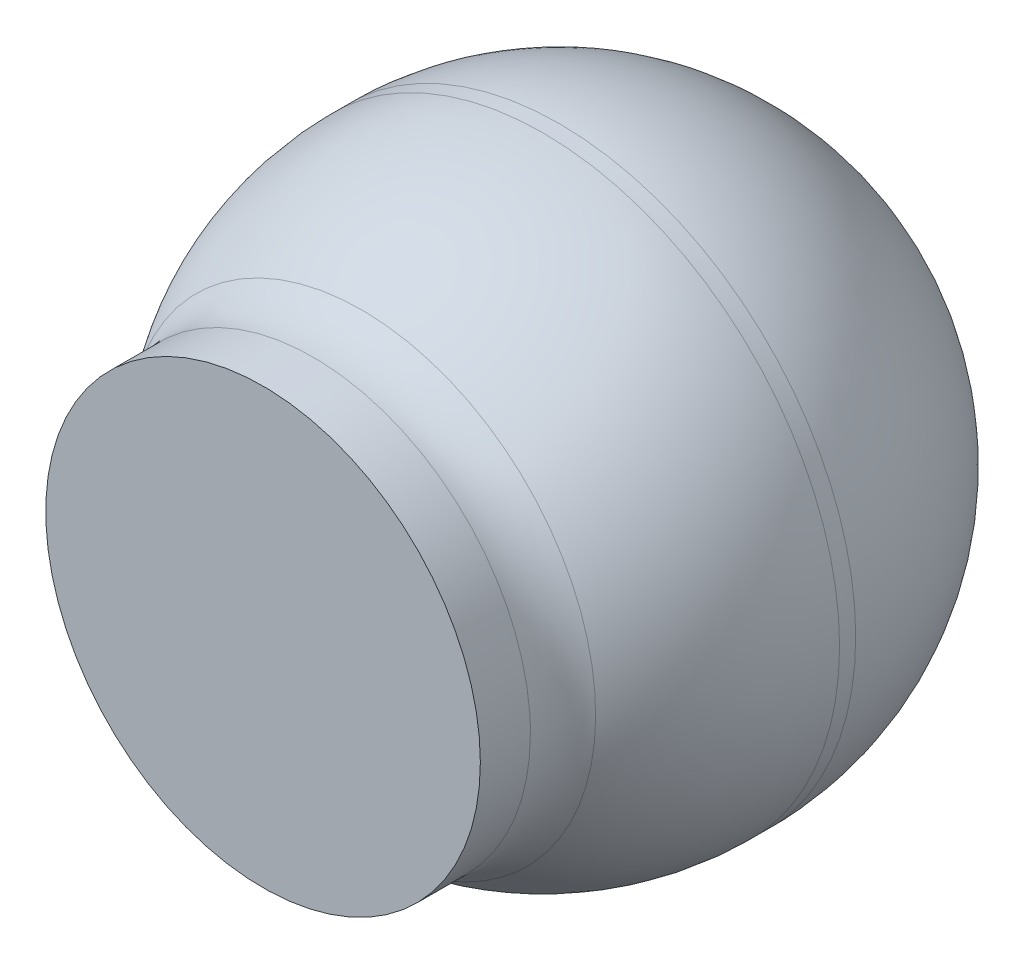
ISO-10303-21;
HEADER;
FILE_DESCRIPTION(('STEP AP214'),'2;1');
FILE_NAME('part.step','',(''),(''),'','','');
FILE_SCHEMA(('AUTOMOTIVE_DESIGN { 1 0 10303 214 1 1 1 1 }'));
ENDSEC;
DATA;
#1=APPLICATION_CONTEXT('core data for automotive mechanical design processes');
#2=APPLICATION_PROTOCOL_DEFINITION('international standard','automotive_design',2000,#1);
#3=PRODUCT_CONTEXT('',#1,'mechanical');
#4=PRODUCT('Part','Part','',(#3));
#5=PRODUCT_RELATED_PRODUCT_CATEGORY('part','',(#4));
#6=PRODUCT_DEFINITION_FORMATION('','',#4);
#7=PRODUCT_DEFINITION_CONTEXT('part definition',#1,'design');
#8=PRODUCT_DEFINITION('design','',#6,#7);
#9=PRODUCT_DEFINITION_SHAPE('','',#8);
#10=(LENGTH_UNIT() NAMED_UNIT(*) SI_UNIT(.MILLI.,.METRE.));
#11=(NAMED_UNIT(*) PLANE_ANGLE_UNIT() SI_UNIT($,.RADIAN.));
#12=(NAMED_UNIT(*) SI_UNIT($,.STERADIAN.) SOLID_ANGLE_UNIT());
#13=UNCERTAINTY_MEASURE_WITH_UNIT(LENGTH_MEASURE(1.E-05),#10,'distance_accuracy_value','');
#14=(GEOMETRIC_REPRESENTATION_CONTEXT(3) GLOBAL_UNCERTAINTY_ASSIGNED_CONTEXT((#13)) GLOBAL_UNIT_ASSIGNED_CONTEXT((#10,
#11,#12)) REPRESENTATION_CONTEXT('',''));
#15=CARTESIAN_POINT('',(0.,0.,0.));
#16=DIRECTION('',(0.,0.,1.));
#17=DIRECTION('',(1.,0.,0.));
#18=AXIS2_PLACEMENT_3D('',#15,#16,#17);
#19=CARTESIAN_POINT('',(-9.452919922269,-2.781349291452,10.006534503384));
#20=DIRECTION('',(0.,0.,-1.));
#21=DIRECTION('',(-1.,0.,0.));
#22=AXIS2_PLACEMENT_3D('',#19,#20,#21);
#23=PLANE('',#22);
#24=CARTESIAN_POINT('',(-9.452919922269,-2.781349291452,10.006534503384));
#25=DIRECTION('',(0.,0.,1.));
#26=DIRECTION('',(1.,0.,0.));
#27=AXIS2_PLACEMENT_3D('',#24,#25,#26);
#28=CIRCLE('',#27,0.275);
#29=CARTESIAN_POINT('',(-9.177919922269,-2.781349291452,10.006534503384));
#30=VERTEX_POINT('',#29);
#31=EDGE_CURVE('E20',#30,#30,#28,.F.);
#32=ORIENTED_EDGE('',*,*,#31,.F.);
#33=EDGE_LOOP('',(#32));
#34=FACE_BOUND('',#33,.T.);
#35=ADVANCED_FACE('F17',(#34),#23,.F.);
#36=CARTESIAN_POINT('',(-9.452919922269,-2.781349291452,9.906534503384));
#37=DIRECTION('',(0.,0.,1.));
#38=DIRECTION('',(1.,0.,0.));
#39=AXIS2_PLACEMENT_3D('',#36,#37,#38);
#40=CYLINDRICAL_SURFACE('',#39,0.275);
#41=CARTESIAN_POINT('',(-9.452919922269,-2.781349291452,9.943180457728));
#42=DIRECTION('',(0.,0.,-1.));
#43=DIRECTION('',(0.996700902337582,0.0811622527992452,0.));
#44=AXIS2_PLACEMENT_3D('',#41,#42,#43);
#45=CIRCLE('',#44,0.275000000000001);
#46=CARTESIAN_POINT('',(-9.17882717412617,-2.75902967193221,9.943180457728));
#47=VERTEX_POINT('',#46);
#48=EDGE_CURVE('E65',#47,#47,#45,.F.);
#49=ORIENTED_EDGE('',*,*,#48,.T.);
#50=EDGE_LOOP('',(#49));
#51=FACE_BOUND('',#50,.T.);
#52=ORIENTED_EDGE('',*,*,#31,.T.);
#53=EDGE_LOOP('',(#52));
#54=FACE_BOUND('',#53,.T.);
#55=ADVANCED_FACE('F62',(#51,#54),#40,.T.);
#56=CARTESIAN_POINT('',(-9.452919922269,-2.781349291452,9.943180457728));
#57=DIRECTION('',(0.,0.,-1.));
#58=DIRECTION('',(0.996700902337583,0.081162252799246,0.));
#59=AXIS2_PLACEMENT_3D('',#56,#57,#58);
#60=TOROIDAL_SURFACE('',#59,0.375,0.1);
#61=ORIENTED_EDGE('',*,*,#48,.F.);
#62=EDGE_LOOP('',(#61));
#63=FACE_BOUND('',#62,.T.);
#64=CARTESIAN_POINT('',(-9.452919922269,-2.781349291452,9.881744931236));
#65=DIRECTION('',(0.,0.,-1.));
#66=DIRECTION('',(-0.996700902337598,-0.0811622527990613,0.));
#67=AXIS2_PLACEMENT_3D('',#64,#65,#66);
#68=CIRCLE('',#67,0.296097046412663);
#69=CARTESIAN_POINT('',(-9.748040115608,-2.805381194786,9.881744931236));
#70=VERTEX_POINT('',#69);
#71=EDGE_CURVE('E39',#70,#70,#68,.T.);
#72=ORIENTED_EDGE('',*,*,#71,.F.);
#73=EDGE_LOOP('',(#72));
#74=FACE_BOUND('',#73,.T.);
#75=ADVANCED_FACE('F57',(#63,#74),#60,.F.);
#76=CARTESIAN_POINT('',(-9.826682760645,-2.811785136252,9.651976062157));
#77=CARTESIAN_POINT('',(-9.826682760645,-2.811785136252,9.701461392103));
#78=CARTESIAN_POINT('',(-9.818526217348,-2.811120941579,9.750947004335));
#79=CARTESIAN_POINT('',(-9.802207085349,-2.809792059952,9.798626332798));
#80=CARTESIAN_POINT('',(-9.778341390838,-2.807848654938,9.842699544317));
#81=CARTESIAN_POINT('',(-9.748040115608,-2.805381194786,9.881744931236));
#82=(BOUNDED_CURVE() B_SPLINE_CURVE(5,(#76,#77,#78,#79,#80,#81),.UNSPECIFIED.,.F.,
.F.) B_SPLINE_CURVE_WITH_KNOTS((6,6),(0.,0.661568582165),
.UNSPECIFIED.) CURVE() GEOMETRIC_REPRESENTATION_ITEM() RATIONAL_B_SPLINE_CURVE((1.,1.,1.,1.,1.,1.)) REPRESENTATION_ITEM(''));
#83=CARTESIAN_POINT('',(-9.452919922269,-2.781349291452,9.651976062157));
#84=DIRECTION('',(0.,0.,-1.));
#85=AXIS1_PLACEMENT('',#83,#84);
#86=SURFACE_OF_REVOLUTION('',#82,#85);
#87=CARTESIAN_POINT('',(-9.452919922269,-2.781349291452,9.651976062157));
#88=DIRECTION('',(0.,0.,1.));
#89=DIRECTION('',(1.,0.,0.));
#90=AXIS2_PLACEMENT_3D('',#87,#88,#89);
#91=CIRCLE('',#90,0.375);
#92=CARTESIAN_POINT('',(-9.077919922269,-2.781349291452,9.651976062157));
#93=VERTEX_POINT('',#92);
#94=EDGE_CURVE('E36',#93,#93,#91,.F.);
#95=ORIENTED_EDGE('',*,*,#94,.F.);
#96=EDGE_LOOP('',(#95));
#97=FACE_BOUND('',#96,.T.);
#98=ORIENTED_EDGE('',*,*,#71,.T.);
#99=EDGE_LOOP('',(#98));
#100=FACE_BOUND('',#99,.T.);
#101=ADVANCED_FACE('F53',(#97,#100),#86,.F.);
#102=CARTESIAN_POINT('',(-9.452919922269,-2.781349291452,9.256534503384));
#103=DIRECTION('',(0.,0.,1.));
#104=DIRECTION('',(1.,0.,0.));
#105=AXIS2_PLACEMENT_3D('',#102,#103,#104);
#106=CYLINDRICAL_SURFACE('',#105,0.375);
#107=CARTESIAN_POINT('',(-9.452919922269,-2.781349291452,9.631534503384));
#108=DIRECTION('',(0.,0.,-1.));
#109=DIRECTION('',(0.0811622527992356,-0.996700902337583,0.));
#110=AXIS2_PLACEMENT_3D('',#107,#108,#109);
#111=CIRCLE('',#110,0.375);
#112=CARTESIAN_POINT('',(-9.42248407746929,-3.15511212982859,9.631534503384));
#113=VERTEX_POINT('',#112);
#114=CARTESIAN_POINT('',(-9.48335576706871,-2.40758645307541,9.631534503384));
#115=VERTEX_POINT('',#114);
#116=EDGE_CURVE('E11',#113,#115,#111,.T.);
#117=ORIENTED_EDGE('',*,*,#116,.F.);
#118=CARTESIAN_POINT('',(-9.452919922269,-2.781349291452,9.631534503384));
#119=DIRECTION('',(3.33436315446763E-12,2.72100352061447E-13,1.));
#120=DIRECTION('',(0.0811622527992366,-0.996700902337583,0.));
#121=AXIS2_PLACEMENT_3D('',#118,#119,#120);
#122=CIRCLE('',#121,0.375);
#123=EDGE_CURVE('E25',#115,#113,#122,.F.);
#124=ORIENTED_EDGE('',*,*,#123,.F.);
#125=EDGE_LOOP('',(#117,#124));
#126=FACE_BOUND('',#125,.T.);
#127=ORIENTED_EDGE('',*,*,#94,.T.);
#128=EDGE_LOOP('',(#127));
#129=FACE_BOUND('',#128,.T.);
#130=ADVANCED_FACE('F34',(#126,#129),#106,.T.);
#131=CARTESIAN_POINT('',(-9.452919922269,-2.781349291452,9.631534503384));
#132=DIRECTION('',(0.0811622527992361,-0.996700902337583,0.));
#133=DIRECTION('',(-0.996700902337583,-0.0811622527992361,0.));
#134=AXIS2_PLACEMENT_3D('',#131,#132,#133);
#135=SPHERICAL_SURFACE('',#134,0.375);
#136=ORIENTED_EDGE('',*,*,#123,.T.);
#137=ORIENTED_EDGE('',*,*,#116,.T.);
#138=EDGE_LOOP('',(#136,#137));
#139=FACE_BOUND('',#138,.T.);
#140=ADVANCED_FACE('F32',(#139),#135,.T.);
#141=CLOSED_SHELL('',(#35,#55,#75,#101,#130,#140));
#142=MANIFOLD_SOLID_BREP('B1',#141);
#143=ADVANCED_BREP_SHAPE_REPRESENTATION('',(#18,#142),#14);
#144=SHAPE_DEFINITION_REPRESENTATION(#9,#143);
ENDSEC;
END-ISO-10303-21;
